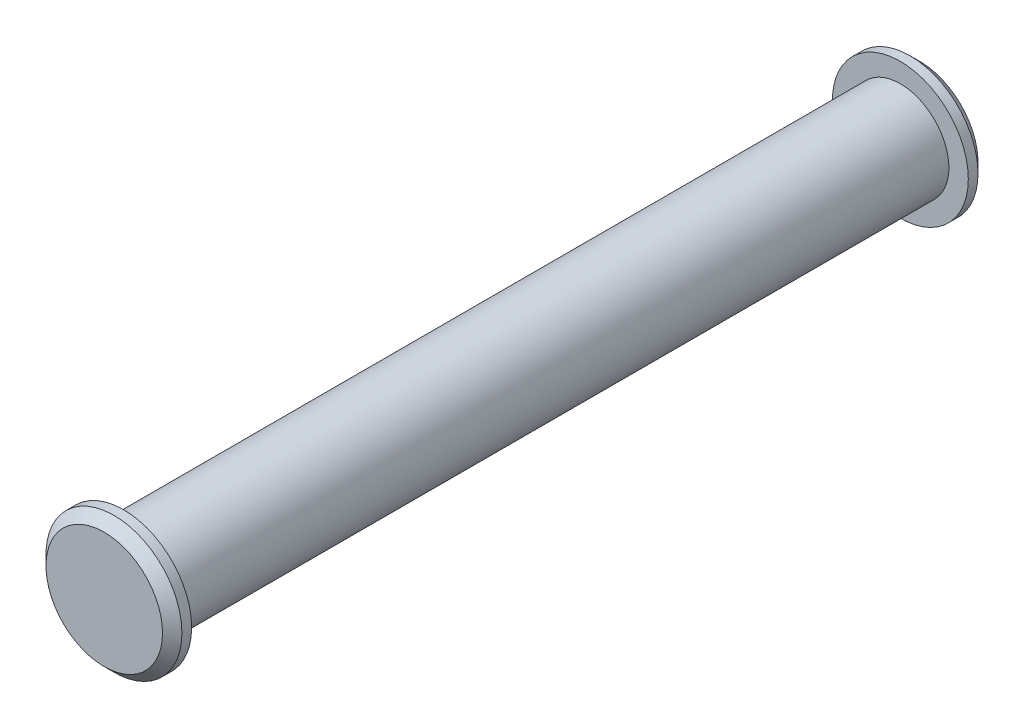
ISO-10303-21;
HEADER;
FILE_DESCRIPTION(('STEP AP214'),'2;1');
FILE_NAME('part.step','',(''),(''),'','','');
FILE_SCHEMA(('AUTOMOTIVE_DESIGN { 1 0 10303 214 1 1 1 1 }'));
ENDSEC;
DATA;
#1=APPLICATION_CONTEXT('core data for automotive mechanical design processes');
#2=APPLICATION_PROTOCOL_DEFINITION('international standard','automotive_design',2000,#1);
#3=PRODUCT_CONTEXT('',#1,'mechanical');
#4=PRODUCT('Part','Part','',(#3));
#5=PRODUCT_RELATED_PRODUCT_CATEGORY('part','',(#4));
#6=PRODUCT_DEFINITION_FORMATION('','',#4);
#7=PRODUCT_DEFINITION_CONTEXT('part definition',#1,'design');
#8=PRODUCT_DEFINITION('design','',#6,#7);
#9=PRODUCT_DEFINITION_SHAPE('','',#8);
#10=(LENGTH_UNIT() NAMED_UNIT(*) SI_UNIT(.MILLI.,.METRE.));
#11=(NAMED_UNIT(*) PLANE_ANGLE_UNIT() SI_UNIT($,.RADIAN.));
#12=(NAMED_UNIT(*) SI_UNIT($,.STERADIAN.) SOLID_ANGLE_UNIT());
#13=UNCERTAINTY_MEASURE_WITH_UNIT(LENGTH_MEASURE(1.E-05),#10,'distance_accuracy_value','');
#14=(GEOMETRIC_REPRESENTATION_CONTEXT(3) GLOBAL_UNCERTAINTY_ASSIGNED_CONTEXT((#13)) GLOBAL_UNIT_ASSIGNED_CONTEXT((#10,
#11,#12)) REPRESENTATION_CONTEXT('',''));
#15=CARTESIAN_POINT('',(0.,0.,0.));
#16=DIRECTION('',(0.,0.,1.));
#17=DIRECTION('',(1.,0.,0.));
#18=AXIS2_PLACEMENT_3D('',#15,#16,#17);
#19=CARTESIAN_POINT('',(0.,0.,20.));
#20=DIRECTION('',(0.,0.,-1.));
#21=DIRECTION('',(-1.,0.,0.));
#22=AXIS2_PLACEMENT_3D('',#19,#20,#21);
#23=CYLINDRICAL_SURFACE('',#22,2.5);
#24=CARTESIAN_POINT('',(0.,0.,20.));
#25=DIRECTION('',(0.,0.,1.));
#26=DIRECTION('',(1.,0.,0.));
#27=AXIS2_PLACEMENT_3D('',#24,#25,#26);
#28=CIRCLE('',#27,2.5);
#29=CARTESIAN_POINT('',(2.5,0.,20.));
#30=VERTEX_POINT('',#29);
#31=EDGE_CURVE('E50',#30,#30,#28,.T.);
#32=ORIENTED_EDGE('',*,*,#31,.F.);
#33=EDGE_LOOP('',(#32));
#34=FACE_BOUND('',#33,.T.);
#35=CARTESIAN_POINT('',(0.,0.,-20.));
#36=DIRECTION('',(0.,0.,-1.));
#37=DIRECTION('',(-1.,0.,0.));
#38=AXIS2_PLACEMENT_3D('',#35,#36,#37);
#39=CIRCLE('',#38,2.5);
#40=CARTESIAN_POINT('',(-2.5,0.,-20.));
#41=VERTEX_POINT('',#40);
#42=EDGE_CURVE('E56',#41,#41,#39,.T.);
#43=ORIENTED_EDGE('',*,*,#42,.F.);
#44=EDGE_LOOP('',(#43));
#45=FACE_BOUND('',#44,.T.);
#46=ADVANCED_FACE('F30',(#34,#45),#23,.T.);
#47=CARTESIAN_POINT('',(0.,0.,20.));
#48=DIRECTION('',(0.,0.,1.));
#49=DIRECTION('',(1.,0.,0.));
#50=AXIS2_PLACEMENT_3D('',#47,#48,#49);
#51=PLANE('',#50);
#52=CARTESIAN_POINT('',(0.,0.,20.));
#53=DIRECTION('',(0.,0.,1.));
#54=DIRECTION('',(1.,0.,0.));
#55=AXIS2_PLACEMENT_3D('',#52,#53,#54);
#56=CIRCLE('',#55,3.5);
#57=CARTESIAN_POINT('',(3.5,0.,20.));
#58=VERTEX_POINT('',#57);
#59=EDGE_CURVE('E53',#58,#58,#56,.T.);
#60=ORIENTED_EDGE('',*,*,#59,.F.);
#61=EDGE_LOOP('',(#60));
#62=FACE_BOUND('',#61,.T.);
#63=ORIENTED_EDGE('',*,*,#31,.T.);
#64=EDGE_LOOP('',(#63));
#65=FACE_BOUND('',#64,.T.);
#66=ADVANCED_FACE('F82',(#62,#65),#51,.F.);
#67=CARTESIAN_POINT('',(0.,0.,21.));
#68=DIRECTION('',(0.,0.,-1.));
#69=DIRECTION('',(-1.,0.,0.));
#70=AXIS2_PLACEMENT_3D('',#67,#68,#69);
#71=CYLINDRICAL_SURFACE('',#70,3.5);
#72=CARTESIAN_POINT('',(0.,0.,20.5));
#73=DIRECTION('',(0.,0.,1.));
#74=DIRECTION('',(1.,0.,0.));
#75=AXIS2_PLACEMENT_3D('',#72,#73,#74);
#76=CIRCLE('',#75,3.5);
#77=CARTESIAN_POINT('',(3.5,0.,20.5));
#78=VERTEX_POINT('',#77);
#79=EDGE_CURVE('E10',#78,#78,#76,.F.);
#80=ORIENTED_EDGE('',*,*,#79,.T.);
#81=EDGE_LOOP('',(#80));
#82=FACE_BOUND('',#81,.T.);
#83=ORIENTED_EDGE('',*,*,#59,.T.);
#84=EDGE_LOOP('',(#83));
#85=FACE_BOUND('',#84,.T.);
#86=ADVANCED_FACE('F88',(#82,#85),#71,.T.);
#87=CARTESIAN_POINT('',(0.,0.,21.));
#88=DIRECTION('',(0.,0.,1.));
#89=DIRECTION('',(1.,0.,0.));
#90=AXIS2_PLACEMENT_3D('',#87,#88,#89);
#91=PLANE('',#90);
#92=CARTESIAN_POINT('',(0.,0.,21.));
#93=DIRECTION('',(0.,0.,1.));
#94=DIRECTION('',(1.,0.,0.));
#95=AXIS2_PLACEMENT_3D('',#92,#93,#94);
#96=CIRCLE('',#95,2.99999999999999);
#97=CARTESIAN_POINT('',(2.99999999999999,0.,21.));
#98=VERTEX_POINT('',#97);
#99=EDGE_CURVE('E37',#98,#98,#96,.T.);
#100=ORIENTED_EDGE('',*,*,#99,.T.);
#101=EDGE_LOOP('',(#100));
#102=FACE_BOUND('',#101,.T.);
#103=ADVANCED_FACE('F78',(#102),#91,.T.);
#104=CARTESIAN_POINT('',(0.,0.,-20.));
#105=DIRECTION('',(0.,0.,-1.));
#106=DIRECTION('',(1.,0.,0.));
#107=AXIS2_PLACEMENT_3D('',#104,#105,#106);
#108=PLANE('',#107);
#109=CARTESIAN_POINT('',(0.,0.,-20.));
#110=DIRECTION('',(0.,0.,1.));
#111=DIRECTION('',(1.,0.,0.));
#112=AXIS2_PLACEMENT_3D('',#109,#110,#111);
#113=CIRCLE('',#112,3.5);
#114=CARTESIAN_POINT('',(3.5,0.,-20.));
#115=VERTEX_POINT('',#114);
#116=EDGE_CURVE('E59',#115,#115,#113,.T.);
#117=ORIENTED_EDGE('',*,*,#116,.T.);
#118=EDGE_LOOP('',(#117));
#119=FACE_BOUND('',#118,.T.);
#120=ORIENTED_EDGE('',*,*,#42,.T.);
#121=EDGE_LOOP('',(#120));
#122=FACE_BOUND('',#121,.T.);
#123=ADVANCED_FACE('F63',(#119,#122),#108,.F.);
#124=CARTESIAN_POINT('',(0.,0.,-21.));
#125=DIRECTION('',(0.,0.,1.));
#126=DIRECTION('',(1.,0.,0.));
#127=AXIS2_PLACEMENT_3D('',#124,#125,#126);
#128=CYLINDRICAL_SURFACE('',#127,3.5);
#129=CARTESIAN_POINT('',(0.,0.,-20.5));
#130=DIRECTION('',(0.,0.,-1.));
#131=DIRECTION('',(-1.,0.,0.));
#132=AXIS2_PLACEMENT_3D('',#129,#130,#131);
#133=CIRCLE('',#132,3.5);
#134=CARTESIAN_POINT('',(-3.5,0.,-20.5));
#135=VERTEX_POINT('',#134);
#136=EDGE_CURVE('E45',#135,#135,#133,.F.);
#137=ORIENTED_EDGE('',*,*,#136,.T.);
#138=EDGE_LOOP('',(#137));
#139=FACE_BOUND('',#138,.T.);
#140=ORIENTED_EDGE('',*,*,#116,.F.);
#141=EDGE_LOOP('',(#140));
#142=FACE_BOUND('',#141,.T.);
#143=ADVANCED_FACE('F66',(#139,#142),#128,.T.);
#144=CARTESIAN_POINT('',(0.,0.,-21.));
#145=DIRECTION('',(0.,0.,-1.));
#146=DIRECTION('',(1.,0.,0.));
#147=AXIS2_PLACEMENT_3D('',#144,#145,#146);
#148=PLANE('',#147);
#149=CARTESIAN_POINT('',(0.,0.,-21.));
#150=DIRECTION('',(0.,0.,-1.));
#151=DIRECTION('',(-1.,0.,0.));
#152=AXIS2_PLACEMENT_3D('',#149,#150,#151);
#153=CIRCLE('',#152,3.);
#154=CARTESIAN_POINT('',(-3.,0.,-21.));
#155=VERTEX_POINT('',#154);
#156=EDGE_CURVE('E41',#155,#155,#153,.T.);
#157=ORIENTED_EDGE('',*,*,#156,.T.);
#158=EDGE_LOOP('',(#157));
#159=FACE_BOUND('',#158,.T.);
#160=ADVANCED_FACE('F68',(#159),#148,.T.);
#161=CARTESIAN_POINT('',(0.,0.,-20.5));
#162=DIRECTION('',(0.,0.,1.));
#163=DIRECTION('',(1.,0.,0.));
#164=AXIS2_PLACEMENT_3D('',#161,#162,#163);
#165=CONICAL_SURFACE('',#164,3.5,0.785398163397452);
#166=ORIENTED_EDGE('',*,*,#156,.F.);
#167=EDGE_LOOP('',(#166));
#168=FACE_BOUND('',#167,.T.);
#169=ORIENTED_EDGE('',*,*,#136,.F.);
#170=EDGE_LOOP('',(#169));
#171=FACE_BOUND('',#170,.T.);
#172=ADVANCED_FACE('F75',(#168,#171),#165,.T.);
#173=CARTESIAN_POINT('',(0.,0.,21.));
#174=DIRECTION('',(0.,0.,-1.));
#175=DIRECTION('',(-1.,0.,0.));
#176=AXIS2_PLACEMENT_3D('',#173,#174,#175);
#177=CONICAL_SURFACE('',#176,2.99999999999999,0.785398163397445);
#178=ORIENTED_EDGE('',*,*,#79,.F.);
#179=EDGE_LOOP('',(#178));
#180=FACE_BOUND('',#179,.T.);
#181=ORIENTED_EDGE('',*,*,#99,.F.);
#182=EDGE_LOOP('',(#181));
#183=FACE_BOUND('',#182,.T.);
#184=ADVANCED_FACE('F32',(#180,#183),#177,.T.);
#185=CLOSED_SHELL('',(#46,#66,#86,#103,#123,#143,#160,#172,#184));
#186=MANIFOLD_SOLID_BREP('B2',#185);
#187=ADVANCED_BREP_SHAPE_REPRESENTATION('',(#18,#186),#14);
#188=SHAPE_DEFINITION_REPRESENTATION(#9,#187);
ENDSEC;
END-ISO-10303-21;
